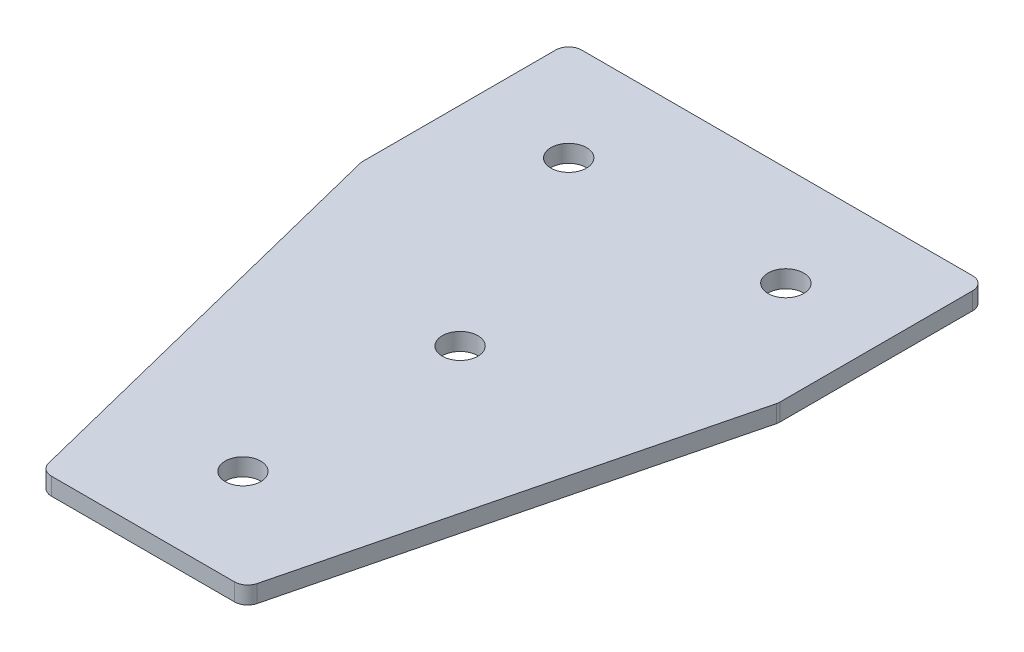
ISO-10303-21;
HEADER;
FILE_DESCRIPTION(('STEP AP214'),'2;1');
FILE_NAME('part.step','',(''),(''),'','','');
FILE_SCHEMA(('AUTOMOTIVE_DESIGN { 1 0 10303 214 1 1 1 1 }'));
ENDSEC;
DATA;
#1=APPLICATION_CONTEXT('core data for automotive mechanical design processes');
#2=APPLICATION_PROTOCOL_DEFINITION('international standard','automotive_design',2000,#1);
#3=PRODUCT_CONTEXT('',#1,'mechanical');
#4=PRODUCT('Part','Part','',(#3));
#5=PRODUCT_RELATED_PRODUCT_CATEGORY('part','',(#4));
#6=PRODUCT_DEFINITION_FORMATION('','',#4);
#7=PRODUCT_DEFINITION_CONTEXT('part definition',#1,'design');
#8=PRODUCT_DEFINITION('design','',#6,#7);
#9=PRODUCT_DEFINITION_SHAPE('','',#8);
#10=(LENGTH_UNIT() NAMED_UNIT(*) SI_UNIT(.MILLI.,.METRE.));
#11=(NAMED_UNIT(*) PLANE_ANGLE_UNIT() SI_UNIT($,.RADIAN.));
#12=(NAMED_UNIT(*) SI_UNIT($,.STERADIAN.) SOLID_ANGLE_UNIT());
#13=UNCERTAINTY_MEASURE_WITH_UNIT(LENGTH_MEASURE(1.E-05),#10,'distance_accuracy_value','');
#14=(GEOMETRIC_REPRESENTATION_CONTEXT(3) GLOBAL_UNCERTAINTY_ASSIGNED_CONTEXT((#13)) GLOBAL_UNIT_ASSIGNED_CONTEXT((#10,
#11,#12)) REPRESENTATION_CONTEXT('',''));
#15=CARTESIAN_POINT('',(0.,0.,0.));
#16=DIRECTION('',(0.,0.,1.));
#17=DIRECTION('',(1.,0.,0.));
#18=AXIS2_PLACEMENT_3D('',#15,#16,#17);
#19=CARTESIAN_POINT('',(-1.82872212002394,0.70798729377475,-50.8788250855786));
#20=DIRECTION('',(0.,-1.,0.));
#21=DIRECTION('',(0.,0.,-1.));
#22=AXIS2_PLACEMENT_3D('',#19,#20,#21);
#23=PLANE('',#22);
#24=CARTESIAN_POINT('',(-1.82872212002395,0.70798729377475,-0.878825085578613));
#25=DIRECTION('',(0.,1.,0.));
#26=DIRECTION('',(0.,0.,1.));
#27=AXIS2_PLACEMENT_3D('',#24,#25,#26);
#28=CIRCLE('',#27,4.1);
#29=CARTESIAN_POINT('',(-1.82872212002395,0.70798729377475,3.22117491442139));
#30=VERTEX_POINT('',#29);
#31=EDGE_CURVE('E171',#30,#30,#28,.T.);
#32=ORIENTED_EDGE('',*,*,#31,.T.);
#33=EDGE_LOOP('',(#32));
#34=FACE_BOUND('',#33,.T.);
#35=DIRECTION('',(1.,0.,0.));
#36=VECTOR('',#35,1.);
#37=CARTESIAN_POINT('',(-24.8287221200239,0.70798729377475,72.1211749144213));
#38=LINE('',#37,#36);
#39=CARTESIAN_POINT('',(-22.9248400880018,0.70798729377475,72.1211749144213));
#40=VERTEX_POINT('',#39);
#41=CARTESIAN_POINT('',(19.267395847954,0.70798729377475,72.1211749144213));
#42=VERTEX_POINT('',#41);
#43=EDGE_CURVE('E189',#40,#42,#38,.T.);
#44=ORIENTED_EDGE('',*,*,#43,.F.);
#45=CARTESIAN_POINT('',(-22.9248400880018,0.70798729377475,69.1211749144213));
#46=DIRECTION('',(0.,1.,0.));
#47=DIRECTION('',(0.,0.,-1.));
#48=AXIS2_PLACEMENT_3D('',#45,#46,#47);
#49=CIRCLE('',#48,3.);
#50=CARTESIAN_POINT('',(-25.8352675884378,0.70798729377475,69.8487817895303));
#51=VERTEX_POINT('',#50);
#52=EDGE_CURVE('E155',#51,#40,#49,.T.);
#53=ORIENTED_EDGE('',*,*,#52,.F.);
#54=DIRECTION('',(-0.242535625036333,0.,-0.970142500145332));
#55=VECTOR('',#54,1.);
#56=CARTESIAN_POINT('',(-25.2671693072151,0.70798729377475,72.1211749144213));
#57=LINE('',#56,#55);
#58=CARTESIAN_POINT('',(-49.7391496204599,0.70798729377475,-25.7667463385578));
#59=VERTEX_POINT('',#58);
#60=EDGE_CURVE('E142',#51,#59,#57,.T.);
#61=ORIENTED_EDGE('',*,*,#60,.T.);
#62=CARTESIAN_POINT('',(-46.8287221200239,0.70798729377475,-26.4943532136668));
#63=DIRECTION('',(0.,1.,0.));
#64=DIRECTION('',(0.,0.,-1.));
#65=AXIS2_PLACEMENT_3D('',#62,#63,#64);
#66=CIRCLE('',#65,3.);
#67=CARTESIAN_POINT('',(-49.8287221200239,0.70798729377475,-26.4943532136668));
#68=VERTEX_POINT('',#67);
#69=EDGE_CURVE('E153',#68,#59,#66,.T.);
#70=ORIENTED_EDGE('',*,*,#69,.F.);
#71=DIRECTION('',(0.,0.,-1.));
#72=VECTOR('',#71,1.);
#73=CARTESIAN_POINT('',(-49.8287221200239,0.70798729377475,-26.1250363368139));
#74=LINE('',#73,#72);
#75=CARTESIAN_POINT('',(-49.8287221200239,0.70798729377475,-70.8788250855787));
#76=VERTEX_POINT('',#75);
#77=EDGE_CURVE('E124',#68,#76,#74,.T.);
#78=ORIENTED_EDGE('',*,*,#77,.T.);
#79=CARTESIAN_POINT('',(-46.8287221200239,0.70798729377475,-70.8788250855787));
#80=DIRECTION('',(0.,1.,0.));
#81=DIRECTION('',(0.,0.,-1.));
#82=AXIS2_PLACEMENT_3D('',#79,#80,#81);
#83=CIRCLE('',#82,3.);
#84=CARTESIAN_POINT('',(-46.8287221200239,0.70798729377475,-73.8788250855787));
#85=VERTEX_POINT('',#84);
#86=EDGE_CURVE('E150',#85,#76,#83,.T.);
#87=ORIENTED_EDGE('',*,*,#86,.F.);
#88=DIRECTION('',(-1.,0.,0.));
#89=VECTOR('',#88,1.);
#90=CARTESIAN_POINT('',(46.171277879976,0.70798729377475,-73.8788250855787));
#91=LINE('',#90,#89);
#92=CARTESIAN_POINT('',(43.171277879976,0.70798729377475,-73.8788250855787));
#93=VERTEX_POINT('',#92);
#94=EDGE_CURVE('E186',#93,#85,#91,.T.);
#95=ORIENTED_EDGE('',*,*,#94,.F.);
#96=CARTESIAN_POINT('',(43.171277879976,0.70798729377475,-70.8788250855787));
#97=DIRECTION('',(0.,-1.,0.));
#98=DIRECTION('',(0.,0.,-1.));
#99=AXIS2_PLACEMENT_3D('',#96,#97,#98);
#100=CIRCLE('',#99,3.);
#101=CARTESIAN_POINT('',(46.171277879976,0.70798729377475,-70.8788250855787));
#102=VERTEX_POINT('',#101);
#103=EDGE_CURVE('E210',#93,#102,#100,.T.);
#104=ORIENTED_EDGE('',*,*,#103,.T.);
#105=DIRECTION('',(0.,0.,-1.));
#106=VECTOR('',#105,1.);
#107=CARTESIAN_POINT('',(46.171277879976,0.70798729377475,-26.1250363368139));
#108=LINE('',#107,#106);
#109=CARTESIAN_POINT('',(46.171277879976,0.70798729377475,-26.4943532136668));
#110=VERTEX_POINT('',#109);
#111=EDGE_CURVE('E183',#110,#102,#108,.T.);
#112=ORIENTED_EDGE('',*,*,#111,.F.);
#113=CARTESIAN_POINT('',(43.171277879976,0.70798729377475,-26.4943532136668));
#114=DIRECTION('',(0.,-1.,0.));
#115=DIRECTION('',(0.,0.,-1.));
#116=AXIS2_PLACEMENT_3D('',#113,#114,#115);
#117=CIRCLE('',#116,3.);
#118=CARTESIAN_POINT('',(46.081705380412,0.70798729377475,-25.7667463385578));
#119=VERTEX_POINT('',#118);
#120=EDGE_CURVE('E31',#110,#119,#117,.T.);
#121=ORIENTED_EDGE('',*,*,#120,.T.);
#122=DIRECTION('',(0.242535625036333,0.,-0.970142500145332));
#123=VECTOR('',#122,1.);
#124=CARTESIAN_POINT('',(21.6097250671672,0.70798729377475,72.1211749144213));
#125=LINE('',#124,#123);
#126=CARTESIAN_POINT('',(22.17782334839,0.70798729377475,69.8487817895303));
#127=VERTEX_POINT('',#126);
#128=EDGE_CURVE('E191',#127,#119,#125,.T.);
#129=ORIENTED_EDGE('',*,*,#128,.F.);
#130=CARTESIAN_POINT('',(19.267395847954,0.70798729377475,69.1211749144213));
#131=DIRECTION('',(0.,-1.,0.));
#132=DIRECTION('',(0.,0.,-1.));
#133=AXIS2_PLACEMENT_3D('',#130,#131,#132);
#134=CIRCLE('',#133,3.);
#135=EDGE_CURVE('E213',#127,#42,#134,.T.);
#136=ORIENTED_EDGE('',*,*,#135,.T.);
#137=EDGE_LOOP('',(#44,#53,#61,#70,#78,#87,#95,#104,#112,#121,#129,#136));
#138=FACE_BOUND('',#137,.T.);
#139=CARTESIAN_POINT('',(-1.82872212002395,0.70798729377475,49.1211749144214));
#140=DIRECTION('',(0.,1.,0.));
#141=DIRECTION('',(0.,0.,1.));
#142=AXIS2_PLACEMENT_3D('',#139,#140,#141);
#143=CIRCLE('',#142,4.1);
#144=CARTESIAN_POINT('',(-1.82872212002395,0.70798729377475,53.2211749144214));
#145=VERTEX_POINT('',#144);
#146=EDGE_CURVE('E165',#145,#145,#143,.T.);
#147=ORIENTED_EDGE('',*,*,#146,.T.);
#148=EDGE_LOOP('',(#147));
#149=FACE_BOUND('',#148,.T.);
#150=CARTESIAN_POINT('',(23.1712778799761,0.70798729377475,-50.8788250855786));
#151=DIRECTION('',(0.,1.,0.));
#152=DIRECTION('',(0.,0.,1.));
#153=AXIS2_PLACEMENT_3D('',#150,#151,#152);
#154=CIRCLE('',#153,4.1);
#155=CARTESIAN_POINT('',(23.1712778799761,0.70798729377475,-46.7788250855786));
#156=VERTEX_POINT('',#155);
#157=EDGE_CURVE('E177',#156,#156,#154,.T.);
#158=ORIENTED_EDGE('',*,*,#157,.T.);
#159=EDGE_LOOP('',(#158));
#160=FACE_BOUND('',#159,.T.);
#161=CARTESIAN_POINT('',(-26.8287221200239,0.70798729377475,-50.8788250855786));
#162=DIRECTION('',(0.,-1.,0.));
#163=DIRECTION('',(0.,0.,1.));
#164=AXIS2_PLACEMENT_3D('',#161,#162,#163);
#165=CIRCLE('',#164,4.1);
#166=CARTESIAN_POINT('',(-26.8287221200239,0.70798729377475,-46.7788250855786));
#167=VERTEX_POINT('',#166);
#168=EDGE_CURVE('E135',#167,#167,#165,.T.);
#169=ORIENTED_EDGE('',*,*,#168,.F.);
#170=EDGE_LOOP('',(#169));
#171=FACE_BOUND('',#170,.T.);
#172=ADVANCED_FACE('F16',(#34,#138,#149,#160,#171),#23,.T.);
#173=CARTESIAN_POINT('',(46.171277879976,0.70798729377475,-26.1250363368139));
#174=DIRECTION('',(1.,0.,0.));
#175=DIRECTION('',(0.,0.,-1.));
#176=AXIS2_PLACEMENT_3D('',#173,#174,#175);
#177=PLANE('',#176);
#178=DIRECTION('',(0.,0.,-1.));
#179=VECTOR('',#178,1.);
#180=CARTESIAN_POINT('',(46.171277879976,4.70798729377475,-26.1250363368139));
#181=LINE('',#180,#179);
#182=CARTESIAN_POINT('',(46.171277879976,4.70798729377475,-26.4943532136668));
#183=VERTEX_POINT('',#182);
#184=CARTESIAN_POINT('',(46.171277879976,4.70798729377475,-70.8788250855787));
#185=VERTEX_POINT('',#184);
#186=EDGE_CURVE('E180',#183,#185,#181,.T.);
#187=ORIENTED_EDGE('',*,*,#186,.F.);
#188=DIRECTION('',(0.,1.,0.));
#189=VECTOR('',#188,1.);
#190=CARTESIAN_POINT('',(46.171277879976,0.70798729377475,-26.4943532136668));
#191=LINE('',#190,#189);
#192=EDGE_CURVE('E24',#183,#110,#191,.F.);
#193=ORIENTED_EDGE('',*,*,#192,.T.);
#194=ORIENTED_EDGE('',*,*,#111,.T.);
#195=DIRECTION('',(0.,1.,0.));
#196=VECTOR('',#195,1.);
#197=CARTESIAN_POINT('',(46.171277879976,0.70798729377475,-70.8788250855787));
#198=LINE('',#197,#196);
#199=EDGE_CURVE('E220',#102,#185,#198,.T.);
#200=ORIENTED_EDGE('',*,*,#199,.T.);
#201=EDGE_LOOP('',(#187,#193,#194,#200));
#202=FACE_BOUND('',#201,.T.);
#203=ADVANCED_FACE('F225',(#202),#177,.T.);
#204=CARTESIAN_POINT('',(21.6097250671672,0.70798729377475,72.1211749144213));
#205=DIRECTION('',(0.970142500145332,0.,0.242535625036333));
#206=DIRECTION('',(0.242535625036333,0.,-0.970142500145332));
#207=AXIS2_PLACEMENT_3D('',#204,#205,#206);
#208=PLANE('',#207);
#209=DIRECTION('',(0.242535625036333,0.,-0.970142500145332));
#210=VECTOR('',#209,1.);
#211=CARTESIAN_POINT('',(21.6097250671672,4.70798729377475,72.1211749144213));
#212=LINE('',#211,#210);
#213=CARTESIAN_POINT('',(22.17782334839,4.70798729377475,69.8487817895303));
#214=VERTEX_POINT('',#213);
#215=CARTESIAN_POINT('',(46.081705380412,4.70798729377475,-25.7667463385578));
#216=VERTEX_POINT('',#215);
#217=EDGE_CURVE('E187',#214,#216,#212,.T.);
#218=ORIENTED_EDGE('',*,*,#217,.F.);
#219=DIRECTION('',(0.,1.,0.));
#220=VECTOR('',#219,1.);
#221=CARTESIAN_POINT('',(22.17782334839,0.70798729377475,69.8487817895303));
#222=LINE('',#221,#220);
#223=EDGE_CURVE('E38',#214,#127,#222,.F.);
#224=ORIENTED_EDGE('',*,*,#223,.T.);
#225=ORIENTED_EDGE('',*,*,#128,.T.);
#226=DIRECTION('',(0.,1.,0.));
#227=VECTOR('',#226,1.);
#228=CARTESIAN_POINT('',(46.081705380412,0.70798729377475,-25.7667463385578));
#229=LINE('',#228,#227);
#230=EDGE_CURVE('E216',#119,#216,#229,.T.);
#231=ORIENTED_EDGE('',*,*,#230,.T.);
#232=EDGE_LOOP('',(#218,#224,#225,#231));
#233=FACE_BOUND('',#232,.T.);
#234=ADVANCED_FACE('F233',(#233),#208,.T.);
#235=CARTESIAN_POINT('',(-24.8287221200239,0.70798729377475,72.1211749144213));
#236=DIRECTION('',(0.,0.,1.));
#237=DIRECTION('',(1.,0.,0.));
#238=AXIS2_PLACEMENT_3D('',#235,#236,#237);
#239=PLANE('',#238);
#240=DIRECTION('',(1.,0.,0.));
#241=VECTOR('',#240,1.);
#242=CARTESIAN_POINT('',(-24.8287221200239,4.70798729377475,72.1211749144213));
#243=LINE('',#242,#241);
#244=CARTESIAN_POINT('',(-22.9248400880018,4.70798729377475,72.1211749144213));
#245=VERTEX_POINT('',#244);
#246=CARTESIAN_POINT('',(19.267395847954,4.70798729377475,72.1211749144213));
#247=VERTEX_POINT('',#246);
#248=EDGE_CURVE('E198',#245,#247,#243,.T.);
#249=ORIENTED_EDGE('',*,*,#248,.F.);
#250=DIRECTION('',(0.,1.,0.));
#251=VECTOR('',#250,1.);
#252=CARTESIAN_POINT('',(-22.9248400880018,0.70798729377475,72.1211749144213));
#253=LINE('',#252,#251);
#254=EDGE_CURVE('E147',#40,#245,#253,.T.);
#255=ORIENTED_EDGE('',*,*,#254,.F.);
#256=ORIENTED_EDGE('',*,*,#43,.T.);
#257=DIRECTION('',(0.,1.,0.));
#258=VECTOR('',#257,1.);
#259=CARTESIAN_POINT('',(19.267395847954,0.70798729377475,72.1211749144213));
#260=LINE('',#259,#258);
#261=EDGE_CURVE('E207',#42,#247,#260,.T.);
#262=ORIENTED_EDGE('',*,*,#261,.T.);
#263=EDGE_LOOP('',(#249,#255,#256,#262));
#264=FACE_BOUND('',#263,.T.);
#265=ADVANCED_FACE('F240',(#264),#239,.T.);
#266=CARTESIAN_POINT('',(46.171277879976,0.70798729377475,-73.8788250855787));
#267=DIRECTION('',(0.,0.,-1.));
#268=DIRECTION('',(-1.,0.,0.));
#269=AXIS2_PLACEMENT_3D('',#266,#267,#268);
#270=PLANE('',#269);
#271=ORIENTED_EDGE('',*,*,#94,.T.);
#272=DIRECTION('',(0.,1.,0.));
#273=VECTOR('',#272,1.);
#274=CARTESIAN_POINT('',(-46.8287221200239,0.70798729377475,-73.8788250855787));
#275=LINE('',#274,#273);
#276=CARTESIAN_POINT('',(-46.8287221200239,4.70798729377475,-73.8788250855787));
#277=VERTEX_POINT('',#276);
#278=EDGE_CURVE('E126',#277,#85,#275,.F.);
#279=ORIENTED_EDGE('',*,*,#278,.F.);
#280=DIRECTION('',(-1.,0.,0.));
#281=VECTOR('',#280,1.);
#282=CARTESIAN_POINT('',(46.171277879976,4.70798729377475,-73.8788250855787));
#283=LINE('',#282,#281);
#284=CARTESIAN_POINT('',(43.171277879976,4.70798729377475,-73.8788250855787));
#285=VERTEX_POINT('',#284);
#286=EDGE_CURVE('E196',#285,#277,#283,.T.);
#287=ORIENTED_EDGE('',*,*,#286,.F.);
#288=DIRECTION('',(0.,1.,0.));
#289=VECTOR('',#288,1.);
#290=CARTESIAN_POINT('',(43.171277879976,0.70798729377475,-73.8788250855787));
#291=LINE('',#290,#289);
#292=EDGE_CURVE('E10',#285,#93,#291,.F.);
#293=ORIENTED_EDGE('',*,*,#292,.T.);
#294=EDGE_LOOP('',(#271,#279,#287,#293));
#295=FACE_BOUND('',#294,.T.);
#296=ADVANCED_FACE('F294',(#295),#270,.T.);
#297=CARTESIAN_POINT('',(-1.82872212002394,4.70798729377475,-50.8788250855786));
#298=DIRECTION('',(0.,-1.,0.));
#299=DIRECTION('',(0.,0.,-1.));
#300=AXIS2_PLACEMENT_3D('',#297,#298,#299);
#301=PLANE('',#300);
#302=CARTESIAN_POINT('',(-1.82872212002395,4.70798729377475,-0.878825085578613));
#303=DIRECTION('',(0.,1.,0.));
#304=DIRECTION('',(0.,0.,1.));
#305=AXIS2_PLACEMENT_3D('',#302,#303,#304);
#306=CIRCLE('',#305,4.1);
#307=CARTESIAN_POINT('',(-1.82872212002395,4.70798729377475,3.22117491442139));
#308=VERTEX_POINT('',#307);
#309=EDGE_CURVE('E168',#308,#308,#306,.T.);
#310=ORIENTED_EDGE('',*,*,#309,.F.);
#311=EDGE_LOOP('',(#310));
#312=FACE_BOUND('',#311,.T.);
#313=CARTESIAN_POINT('',(-22.9248400880018,4.70798729377475,69.1211749144213));
#314=DIRECTION('',(0.,1.,0.));
#315=DIRECTION('',(0.,0.,-1.));
#316=AXIS2_PLACEMENT_3D('',#313,#314,#315);
#317=CIRCLE('',#316,3.);
#318=CARTESIAN_POINT('',(-25.8352675884378,4.70798729377475,69.8487817895303));
#319=VERTEX_POINT('',#318);
#320=EDGE_CURVE('E116',#245,#319,#317,.F.);
#321=ORIENTED_EDGE('',*,*,#320,.F.);
#322=ORIENTED_EDGE('',*,*,#248,.T.);
#323=CARTESIAN_POINT('',(19.267395847954,4.70798729377475,69.1211749144213));
#324=DIRECTION('',(0.,-1.,0.));
#325=DIRECTION('',(0.,0.,-1.));
#326=AXIS2_PLACEMENT_3D('',#323,#324,#325);
#327=CIRCLE('',#326,3.);
#328=EDGE_CURVE('E205',#247,#214,#327,.F.);
#329=ORIENTED_EDGE('',*,*,#328,.T.);
#330=ORIENTED_EDGE('',*,*,#217,.T.);
#331=CARTESIAN_POINT('',(43.171277879976,4.70798729377475,-26.4943532136668));
#332=DIRECTION('',(0.,-1.,0.));
#333=DIRECTION('',(0.,0.,-1.));
#334=AXIS2_PLACEMENT_3D('',#331,#332,#333);
#335=CIRCLE('',#334,3.);
#336=EDGE_CURVE('E203',#216,#183,#335,.F.);
#337=ORIENTED_EDGE('',*,*,#336,.T.);
#338=ORIENTED_EDGE('',*,*,#186,.T.);
#339=CARTESIAN_POINT('',(43.171277879976,4.70798729377475,-70.8788250855787));
#340=DIRECTION('',(0.,-1.,0.));
#341=DIRECTION('',(0.,0.,-1.));
#342=AXIS2_PLACEMENT_3D('',#339,#340,#341);
#343=CIRCLE('',#342,3.);
#344=EDGE_CURVE('E193',#185,#285,#343,.F.);
#345=ORIENTED_EDGE('',*,*,#344,.T.);
#346=ORIENTED_EDGE('',*,*,#286,.T.);
#347=CARTESIAN_POINT('',(-46.8287221200239,4.70798729377475,-70.8788250855787));
#348=DIRECTION('',(0.,1.,0.));
#349=DIRECTION('',(0.,0.,-1.));
#350=AXIS2_PLACEMENT_3D('',#347,#348,#349);
#351=CIRCLE('',#350,3.);
#352=CARTESIAN_POINT('',(-49.8287221200239,4.70798729377475,-70.8788250855787));
#353=VERTEX_POINT('',#352);
#354=EDGE_CURVE('E117',#353,#277,#351,.F.);
#355=ORIENTED_EDGE('',*,*,#354,.F.);
#356=DIRECTION('',(0.,0.,-1.));
#357=VECTOR('',#356,1.);
#358=CARTESIAN_POINT('',(-49.8287221200239,4.70798729377475,-26.1250363368139));
#359=LINE('',#358,#357);
#360=CARTESIAN_POINT('',(-49.8287221200239,4.70798729377475,-26.4943532136668));
#361=VERTEX_POINT('',#360);
#362=EDGE_CURVE('E122',#361,#353,#359,.T.);
#363=ORIENTED_EDGE('',*,*,#362,.F.);
#364=CARTESIAN_POINT('',(-46.8287221200239,4.70798729377475,-26.4943532136668));
#365=DIRECTION('',(0.,1.,0.));
#366=DIRECTION('',(0.,0.,-1.));
#367=AXIS2_PLACEMENT_3D('',#364,#365,#366);
#368=CIRCLE('',#367,3.);
#369=CARTESIAN_POINT('',(-49.7391496204599,4.70798729377475,-25.7667463385578));
#370=VERTEX_POINT('',#369);
#371=EDGE_CURVE('E105',#370,#361,#368,.F.);
#372=ORIENTED_EDGE('',*,*,#371,.F.);
#373=DIRECTION('',(-0.242535625036333,0.,-0.970142500145332));
#374=VECTOR('',#373,1.);
#375=CARTESIAN_POINT('',(-25.2671693072151,4.70798729377475,72.1211749144213));
#376=LINE('',#375,#374);
#377=EDGE_CURVE('E134',#319,#370,#376,.T.);
#378=ORIENTED_EDGE('',*,*,#377,.F.);
#379=EDGE_LOOP('',(#321,#322,#329,#330,#337,#338,#345,#346,#355,#363,#372,#378));
#380=FACE_BOUND('',#379,.T.);
#381=CARTESIAN_POINT('',(-1.82872212002395,4.70798729377475,49.1211749144214));
#382=DIRECTION('',(0.,1.,0.));
#383=DIRECTION('',(0.,0.,1.));
#384=AXIS2_PLACEMENT_3D('',#381,#382,#383);
#385=CIRCLE('',#384,4.1);
#386=CARTESIAN_POINT('',(-1.82872212002395,4.70798729377475,53.2211749144214));
#387=VERTEX_POINT('',#386);
#388=EDGE_CURVE('E164',#387,#387,#385,.T.);
#389=ORIENTED_EDGE('',*,*,#388,.F.);
#390=EDGE_LOOP('',(#389));
#391=FACE_BOUND('',#390,.T.);
#392=CARTESIAN_POINT('',(23.1712778799761,4.70798729377475,-50.8788250855786));
#393=DIRECTION('',(0.,1.,0.));
#394=DIRECTION('',(0.,0.,1.));
#395=AXIS2_PLACEMENT_3D('',#392,#393,#394);
#396=CIRCLE('',#395,4.1);
#397=CARTESIAN_POINT('',(23.1712778799761,4.70798729377475,-46.7788250855786));
#398=VERTEX_POINT('',#397);
#399=EDGE_CURVE('E174',#398,#398,#396,.T.);
#400=ORIENTED_EDGE('',*,*,#399,.F.);
#401=EDGE_LOOP('',(#400));
#402=FACE_BOUND('',#401,.T.);
#403=CARTESIAN_POINT('',(-26.8287221200239,4.70798729377475,-50.8788250855786));
#404=DIRECTION('',(0.,-1.,0.));
#405=DIRECTION('',(0.,0.,1.));
#406=AXIS2_PLACEMENT_3D('',#403,#404,#405);
#407=CIRCLE('',#406,4.1);
#408=CARTESIAN_POINT('',(-26.8287221200239,4.70798729377475,-46.7788250855786));
#409=VERTEX_POINT('',#408);
#410=EDGE_CURVE('E139',#409,#409,#407,.T.);
#411=ORIENTED_EDGE('',*,*,#410,.T.);
#412=EDGE_LOOP('',(#411));
#413=FACE_BOUND('',#412,.T.);
#414=ADVANCED_FACE('F130',(#312,#380,#391,#402,#413),#301,.F.);
#415=CARTESIAN_POINT('',(19.267395847954,0.70798729377475,69.1211749144213));
#416=DIRECTION('',(0.,1.,0.));
#417=DIRECTION('',(0.,0.,1.));
#418=AXIS2_PLACEMENT_3D('',#415,#416,#417);
#419=CYLINDRICAL_SURFACE('',#418,3.);
#420=ORIENTED_EDGE('',*,*,#135,.F.);
#421=ORIENTED_EDGE('',*,*,#223,.F.);
#422=ORIENTED_EDGE('',*,*,#328,.F.);
#423=ORIENTED_EDGE('',*,*,#261,.F.);
#424=EDGE_LOOP('',(#420,#421,#422,#423));
#425=FACE_BOUND('',#424,.T.);
#426=ADVANCED_FACE('F238',(#425),#419,.T.);
#427=CARTESIAN_POINT('',(43.171277879976,0.70798729377475,-26.4943532136668));
#428=DIRECTION('',(0.,1.,0.));
#429=DIRECTION('',(0.,0.,1.));
#430=AXIS2_PLACEMENT_3D('',#427,#428,#429);
#431=CYLINDRICAL_SURFACE('',#430,3.);
#432=ORIENTED_EDGE('',*,*,#120,.F.);
#433=ORIENTED_EDGE('',*,*,#192,.F.);
#434=ORIENTED_EDGE('',*,*,#336,.F.);
#435=ORIENTED_EDGE('',*,*,#230,.F.);
#436=EDGE_LOOP('',(#432,#433,#434,#435));
#437=FACE_BOUND('',#436,.T.);
#438=ADVANCED_FACE('F232',(#437),#431,.T.);
#439=CARTESIAN_POINT('',(43.171277879976,0.70798729377475,-70.8788250855787));
#440=DIRECTION('',(0.,1.,0.));
#441=DIRECTION('',(0.,0.,1.));
#442=AXIS2_PLACEMENT_3D('',#439,#440,#441);
#443=CYLINDRICAL_SURFACE('',#442,3.);
#444=ORIENTED_EDGE('',*,*,#103,.F.);
#445=ORIENTED_EDGE('',*,*,#292,.F.);
#446=ORIENTED_EDGE('',*,*,#344,.F.);
#447=ORIENTED_EDGE('',*,*,#199,.F.);
#448=EDGE_LOOP('',(#444,#445,#446,#447));
#449=FACE_BOUND('',#448,.T.);
#450=ADVANCED_FACE('F18',(#449),#443,.T.);
#451=CARTESIAN_POINT('',(23.1712778799761,0.70798729377475,-50.8788250855786));
#452=DIRECTION('',(0.,1.,0.));
#453=DIRECTION('',(0.,0.,1.));
#454=AXIS2_PLACEMENT_3D('',#451,#452,#453);
#455=CYLINDRICAL_SURFACE('',#454,4.1);
#456=ORIENTED_EDGE('',*,*,#157,.F.);
#457=EDGE_LOOP('',(#456));
#458=FACE_BOUND('',#457,.T.);
#459=ORIENTED_EDGE('',*,*,#399,.T.);
#460=EDGE_LOOP('',(#459));
#461=FACE_BOUND('',#460,.T.);
#462=ADVANCED_FACE('F282',(#458,#461),#455,.F.);
#463=CARTESIAN_POINT('',(-1.82872212002395,0.70798729377475,-0.878825085578613));
#464=DIRECTION('',(0.,1.,0.));
#465=DIRECTION('',(0.,0.,1.));
#466=AXIS2_PLACEMENT_3D('',#463,#464,#465);
#467=CYLINDRICAL_SURFACE('',#466,4.1);
#468=ORIENTED_EDGE('',*,*,#31,.F.);
#469=EDGE_LOOP('',(#468));
#470=FACE_BOUND('',#469,.T.);
#471=ORIENTED_EDGE('',*,*,#309,.T.);
#472=EDGE_LOOP('',(#471));
#473=FACE_BOUND('',#472,.T.);
#474=ADVANCED_FACE('F287',(#470,#473),#467,.F.);
#475=CARTESIAN_POINT('',(-1.82872212002395,0.70798729377475,49.1211749144214));
#476=DIRECTION('',(0.,1.,0.));
#477=DIRECTION('',(0.,0.,1.));
#478=AXIS2_PLACEMENT_3D('',#475,#476,#477);
#479=CYLINDRICAL_SURFACE('',#478,4.1);
#480=ORIENTED_EDGE('',*,*,#388,.T.);
#481=EDGE_LOOP('',(#480));
#482=FACE_BOUND('',#481,.T.);
#483=ORIENTED_EDGE('',*,*,#146,.F.);
#484=EDGE_LOOP('',(#483));
#485=FACE_BOUND('',#484,.T.);
#486=ADVANCED_FACE('F308',(#482,#485),#479,.F.);
#487=CARTESIAN_POINT('',(-49.8287221200239,0.70798729377475,-26.1250363368139));
#488=DIRECTION('',(-1.,0.,0.));
#489=DIRECTION('',(0.,0.,-1.));
#490=AXIS2_PLACEMENT_3D('',#487,#488,#489);
#491=PLANE('',#490);
#492=ORIENTED_EDGE('',*,*,#362,.T.);
#493=DIRECTION('',(0.,1.,0.));
#494=VECTOR('',#493,1.);
#495=CARTESIAN_POINT('',(-49.8287221200239,0.70798729377475,-70.8788250855787));
#496=LINE('',#495,#494);
#497=EDGE_CURVE('E127',#76,#353,#496,.T.);
#498=ORIENTED_EDGE('',*,*,#497,.F.);
#499=ORIENTED_EDGE('',*,*,#77,.F.);
#500=DIRECTION('',(0.,1.,0.));
#501=VECTOR('',#500,1.);
#502=CARTESIAN_POINT('',(-49.8287221200239,0.70798729377475,-26.4943532136668));
#503=LINE('',#502,#501);
#504=EDGE_CURVE('E109',#361,#68,#503,.F.);
#505=ORIENTED_EDGE('',*,*,#504,.F.);
#506=EDGE_LOOP('',(#492,#498,#499,#505));
#507=FACE_BOUND('',#506,.T.);
#508=ADVANCED_FACE('F121',(#507),#491,.T.);
#509=CARTESIAN_POINT('',(-25.2671693072151,0.70798729377475,72.1211749144213));
#510=DIRECTION('',(-0.970142500145332,0.,0.242535625036333));
#511=DIRECTION('',(-0.242535625036333,0.,-0.970142500145332));
#512=AXIS2_PLACEMENT_3D('',#509,#510,#511);
#513=PLANE('',#512);
#514=ORIENTED_EDGE('',*,*,#377,.T.);
#515=DIRECTION('',(0.,1.,0.));
#516=VECTOR('',#515,1.);
#517=CARTESIAN_POINT('',(-49.7391496204599,0.70798729377475,-25.7667463385578));
#518=LINE('',#517,#516);
#519=EDGE_CURVE('E111',#59,#370,#518,.T.);
#520=ORIENTED_EDGE('',*,*,#519,.F.);
#521=ORIENTED_EDGE('',*,*,#60,.F.);
#522=DIRECTION('',(0.,1.,0.));
#523=VECTOR('',#522,1.);
#524=CARTESIAN_POINT('',(-25.8352675884378,0.70798729377475,69.8487817895303));
#525=LINE('',#524,#523);
#526=EDGE_CURVE('E159',#319,#51,#525,.F.);
#527=ORIENTED_EDGE('',*,*,#526,.F.);
#528=EDGE_LOOP('',(#514,#520,#521,#527));
#529=FACE_BOUND('',#528,.T.);
#530=ADVANCED_FACE('F249',(#529),#513,.T.);
#531=CARTESIAN_POINT('',(-22.9248400880018,0.70798729377475,69.1211749144213));
#532=DIRECTION('',(0.,1.,0.));
#533=DIRECTION('',(0.,0.,1.));
#534=AXIS2_PLACEMENT_3D('',#531,#532,#533);
#535=CYLINDRICAL_SURFACE('',#534,3.);
#536=ORIENTED_EDGE('',*,*,#52,.T.);
#537=ORIENTED_EDGE('',*,*,#254,.T.);
#538=ORIENTED_EDGE('',*,*,#320,.T.);
#539=ORIENTED_EDGE('',*,*,#526,.T.);
#540=EDGE_LOOP('',(#536,#537,#538,#539));
#541=FACE_BOUND('',#540,.T.);
#542=ADVANCED_FACE('F246',(#541),#535,.T.);
#543=CARTESIAN_POINT('',(-46.8287221200239,0.70798729377475,-26.4943532136668));
#544=DIRECTION('',(0.,1.,0.));
#545=DIRECTION('',(0.,0.,1.));
#546=AXIS2_PLACEMENT_3D('',#543,#544,#545);
#547=CYLINDRICAL_SURFACE('',#546,3.);
#548=ORIENTED_EDGE('',*,*,#69,.T.);
#549=ORIENTED_EDGE('',*,*,#519,.T.);
#550=ORIENTED_EDGE('',*,*,#371,.T.);
#551=ORIENTED_EDGE('',*,*,#504,.T.);
#552=EDGE_LOOP('',(#548,#549,#550,#551));
#553=FACE_BOUND('',#552,.T.);
#554=ADVANCED_FACE('F108',(#553),#547,.T.);
#555=CARTESIAN_POINT('',(-46.8287221200239,0.70798729377475,-70.8788250855787));
#556=DIRECTION('',(0.,1.,0.));
#557=DIRECTION('',(0.,0.,1.));
#558=AXIS2_PLACEMENT_3D('',#555,#556,#557);
#559=CYLINDRICAL_SURFACE('',#558,3.);
#560=ORIENTED_EDGE('',*,*,#86,.T.);
#561=ORIENTED_EDGE('',*,*,#497,.T.);
#562=ORIENTED_EDGE('',*,*,#354,.T.);
#563=ORIENTED_EDGE('',*,*,#278,.T.);
#564=EDGE_LOOP('',(#560,#561,#562,#563));
#565=FACE_BOUND('',#564,.T.);
#566=ADVANCED_FACE('F258',(#565),#559,.T.);
#567=CARTESIAN_POINT('',(-26.8287221200239,0.70798729377475,-50.8788250855786));
#568=DIRECTION('',(0.,1.,0.));
#569=DIRECTION('',(0.,0.,1.));
#570=AXIS2_PLACEMENT_3D('',#567,#568,#569);
#571=CYLINDRICAL_SURFACE('',#570,4.1);
#572=ORIENTED_EDGE('',*,*,#168,.T.);
#573=EDGE_LOOP('',(#572));
#574=FACE_BOUND('',#573,.T.);
#575=ORIENTED_EDGE('',*,*,#410,.F.);
#576=EDGE_LOOP('',(#575));
#577=FACE_BOUND('',#576,.T.);
#578=ADVANCED_FACE('F256',(#574,#577),#571,.F.);
#579=CLOSED_SHELL('',(#172,#203,#234,#265,#296,#414,#426,#438,#450,#462,#474,#486,#508,#530,
#542,#554,#566,#578));
#580=MANIFOLD_SOLID_BREP('B1',#579);
#581=ADVANCED_BREP_SHAPE_REPRESENTATION('',(#18,#580),#14);
#582=SHAPE_DEFINITION_REPRESENTATION(#9,#581);
ENDSEC;
END-ISO-10303-21;
